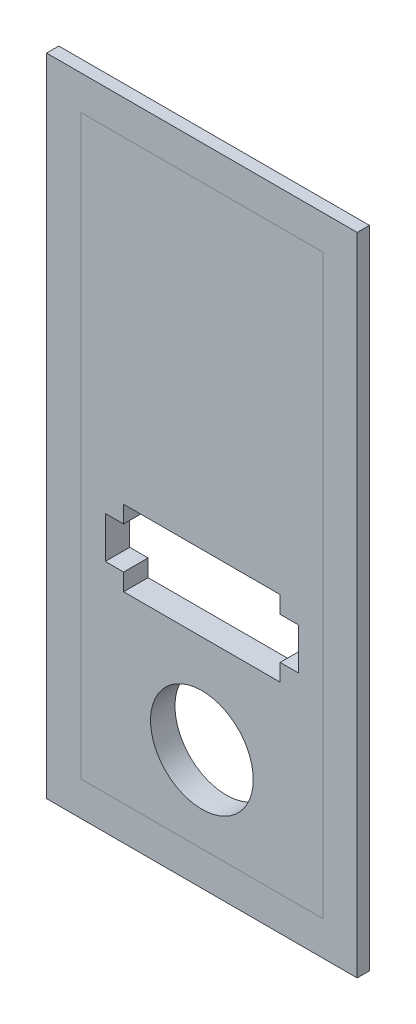
ISO-10303-21;
HEADER;
FILE_DESCRIPTION(('STEP AP214'),'2;1');
FILE_NAME('part.step','',(''),(''),'','','');
FILE_SCHEMA(('AUTOMOTIVE_DESIGN { 1 0 10303 214 1 1 1 1 }'));
ENDSEC;
DATA;
#1=APPLICATION_CONTEXT('core data for automotive mechanical design processes');
#2=APPLICATION_PROTOCOL_DEFINITION('international standard','automotive_design',2000,#1);
#3=PRODUCT_CONTEXT('',#1,'mechanical');
#4=PRODUCT('Part','Part','',(#3));
#5=PRODUCT_RELATED_PRODUCT_CATEGORY('part','',(#4));
#6=PRODUCT_DEFINITION_FORMATION('','',#4);
#7=PRODUCT_DEFINITION_CONTEXT('part definition',#1,'design');
#8=PRODUCT_DEFINITION('design','',#6,#7);
#9=PRODUCT_DEFINITION_SHAPE('','',#8);
#10=(LENGTH_UNIT() NAMED_UNIT(*) SI_UNIT(.MILLI.,.METRE.));
#11=(NAMED_UNIT(*) PLANE_ANGLE_UNIT() SI_UNIT($,.RADIAN.));
#12=(NAMED_UNIT(*) SI_UNIT($,.STERADIAN.) SOLID_ANGLE_UNIT());
#13=UNCERTAINTY_MEASURE_WITH_UNIT(LENGTH_MEASURE(1.E-05),#10,'distance_accuracy_value','');
#14=(GEOMETRIC_REPRESENTATION_CONTEXT(3) GLOBAL_UNCERTAINTY_ASSIGNED_CONTEXT((#13)) GLOBAL_UNIT_ASSIGNED_CONTEXT((#10,
#11,#12)) REPRESENTATION_CONTEXT('',''));
#15=CARTESIAN_POINT('',(0.,0.,0.));
#16=DIRECTION('',(0.,0.,1.));
#17=DIRECTION('',(1.,0.,0.));
#18=AXIS2_PLACEMENT_3D('',#15,#16,#17);
#19=CARTESIAN_POINT('',(-12.7,43.,1.));
#20=DIRECTION('',(0.,1.,0.));
#21=DIRECTION('',(0.,0.,1.));
#22=AXIS2_PLACEMENT_3D('',#19,#20,#21);
#23=PLANE('',#22);
#24=DIRECTION('',(-1.,0.,0.));
#25=VECTOR('',#24,1.);
#26=CARTESIAN_POINT('',(-12.7,43.,2.));
#27=LINE('',#26,#25);
#28=CARTESIAN_POINT('',(12.7,43.,2.));
#29=VERTEX_POINT('',#28);
#30=CARTESIAN_POINT('',(-12.7,43.,2.));
#31=VERTEX_POINT('',#30);
#32=EDGE_CURVE('E149',#29,#31,#27,.T.);
#33=ORIENTED_EDGE('',*,*,#32,.F.);
#34=DIRECTION('',(0.,0.,1.));
#35=VECTOR('',#34,1.);
#36=CARTESIAN_POINT('',(12.7,43.,1.));
#37=LINE('',#36,#35);
#38=CARTESIAN_POINT('',(12.7,43.,1.));
#39=VERTEX_POINT('',#38);
#40=EDGE_CURVE('E12',#39,#29,#37,.T.);
#41=ORIENTED_EDGE('',*,*,#40,.F.);
#42=DIRECTION('',(-1.,0.,0.));
#43=VECTOR('',#42,1.);
#44=CARTESIAN_POINT('',(-12.7,43.,1.));
#45=LINE('',#44,#43);
#46=CARTESIAN_POINT('',(-12.7,43.,1.));
#47=VERTEX_POINT('',#46);
#48=EDGE_CURVE('E153',#39,#47,#45,.T.);
#49=ORIENTED_EDGE('',*,*,#48,.T.);
#50=DIRECTION('',(0.,0.,1.));
#51=VECTOR('',#50,1.);
#52=CARTESIAN_POINT('',(-12.7,43.,1.));
#53=LINE('',#52,#51);
#54=EDGE_CURVE('E54',#47,#31,#53,.T.);
#55=ORIENTED_EDGE('',*,*,#54,.T.);
#56=EDGE_LOOP('',(#33,#41,#49,#55));
#57=FACE_BOUND('',#56,.T.);
#58=ADVANCED_FACE('F51',(#57),#23,.T.);
#59=CARTESIAN_POINT('',(12.7,43.,1.));
#60=DIRECTION('',(1.,0.,0.));
#61=DIRECTION('',(0.,1.,0.));
#62=AXIS2_PLACEMENT_3D('',#59,#60,#61);
#63=PLANE('',#62);
#64=DIRECTION('',(0.,1.,0.));
#65=VECTOR('',#64,1.);
#66=CARTESIAN_POINT('',(12.7,43.,2.));
#67=LINE('',#66,#65);
#68=CARTESIAN_POINT('',(12.7,-9.8,2.));
#69=VERTEX_POINT('',#68);
#70=EDGE_CURVE('E157',#69,#29,#67,.T.);
#71=ORIENTED_EDGE('',*,*,#70,.F.);
#72=DIRECTION('',(0.,0.,1.));
#73=VECTOR('',#72,1.);
#74=CARTESIAN_POINT('',(12.7,-9.8,1.));
#75=LINE('',#74,#73);
#76=CARTESIAN_POINT('',(12.7,-9.8,1.));
#77=VERTEX_POINT('',#76);
#78=EDGE_CURVE('E59',#77,#69,#75,.T.);
#79=ORIENTED_EDGE('',*,*,#78,.F.);
#80=DIRECTION('',(0.,1.,0.));
#81=VECTOR('',#80,1.);
#82=CARTESIAN_POINT('',(12.7,43.,1.));
#83=LINE('',#82,#81);
#84=EDGE_CURVE('E163',#77,#39,#83,.T.);
#85=ORIENTED_EDGE('',*,*,#84,.T.);
#86=ORIENTED_EDGE('',*,*,#40,.T.);
#87=EDGE_LOOP('',(#71,#79,#85,#86));
#88=FACE_BOUND('',#87,.T.);
#89=ADVANCED_FACE('F189',(#88),#63,.T.);
#90=CARTESIAN_POINT('',(-12.7,-9.8,1.));
#91=DIRECTION('',(0.,-1.,0.));
#92=DIRECTION('',(1.,0.,0.));
#93=AXIS2_PLACEMENT_3D('',#90,#91,#92);
#94=PLANE('',#93);
#95=DIRECTION('',(1.,0.,0.));
#96=VECTOR('',#95,1.);
#97=CARTESIAN_POINT('',(-12.7,-9.8,2.));
#98=LINE('',#97,#96);
#99=CARTESIAN_POINT('',(-12.7,-9.8,2.));
#100=VERTEX_POINT('',#99);
#101=EDGE_CURVE('E171',#100,#69,#98,.T.);
#102=ORIENTED_EDGE('',*,*,#101,.F.);
#103=DIRECTION('',(0.,0.,1.));
#104=VECTOR('',#103,1.);
#105=CARTESIAN_POINT('',(-12.7,-9.8,1.));
#106=LINE('',#105,#104);
#107=CARTESIAN_POINT('',(-12.7,-9.8,1.));
#108=VERTEX_POINT('',#107);
#109=EDGE_CURVE('E176',#108,#100,#106,.T.);
#110=ORIENTED_EDGE('',*,*,#109,.F.);
#111=DIRECTION('',(1.,0.,0.));
#112=VECTOR('',#111,1.);
#113=CARTESIAN_POINT('',(-12.7,-9.8,1.));
#114=LINE('',#113,#112);
#115=EDGE_CURVE('E160',#108,#77,#114,.T.);
#116=ORIENTED_EDGE('',*,*,#115,.T.);
#117=ORIENTED_EDGE('',*,*,#78,.T.);
#118=EDGE_LOOP('',(#102,#110,#116,#117));
#119=FACE_BOUND('',#118,.T.);
#120=ADVANCED_FACE('F193',(#119),#94,.T.);
#121=CARTESIAN_POINT('',(-12.7,43.,1.));
#122=DIRECTION('',(-1.,0.,0.));
#123=DIRECTION('',(0.,-1.,0.));
#124=AXIS2_PLACEMENT_3D('',#121,#122,#123);
#125=PLANE('',#124);
#126=DIRECTION('',(0.,-1.,0.));
#127=VECTOR('',#126,1.);
#128=CARTESIAN_POINT('',(-12.7,43.,2.));
#129=LINE('',#128,#127);
#130=EDGE_CURVE('E168',#31,#100,#129,.T.);
#131=ORIENTED_EDGE('',*,*,#130,.F.);
#132=ORIENTED_EDGE('',*,*,#54,.F.);
#133=DIRECTION('',(0.,-1.,0.));
#134=VECTOR('',#133,1.);
#135=CARTESIAN_POINT('',(-12.7,43.,1.));
#136=LINE('',#135,#134);
#137=EDGE_CURVE('E156',#47,#108,#136,.T.);
#138=ORIENTED_EDGE('',*,*,#137,.T.);
#139=ORIENTED_EDGE('',*,*,#109,.T.);
#140=EDGE_LOOP('',(#131,#132,#138,#139));
#141=FACE_BOUND('',#140,.T.);
#142=ADVANCED_FACE('F184',(#141),#125,.T.);
#143=CARTESIAN_POINT('',(0.,0.,1.));
#144=DIRECTION('',(0.,0.,-1.));
#145=DIRECTION('',(-1.,0.,0.));
#146=AXIS2_PLACEMENT_3D('',#143,#144,#145);
#147=PLANE('',#146);
#148=DIRECTION('',(0.,-1.,0.));
#149=VECTOR('',#148,1.);
#150=CARTESIAN_POINT('',(-9.9,40.2,1.));
#151=LINE('',#150,#149);
#152=CARTESIAN_POINT('',(-9.9,40.2,1.));
#153=VERTEX_POINT('',#152);
#154=CARTESIAN_POINT('',(-9.9,-7.,1.));
#155=VERTEX_POINT('',#154);
#156=EDGE_CURVE('E118',#153,#155,#151,.T.);
#157=ORIENTED_EDGE('',*,*,#156,.T.);
#158=DIRECTION('',(1.,0.,0.));
#159=VECTOR('',#158,1.);
#160=CARTESIAN_POINT('',(-9.9,-7.,1.));
#161=LINE('',#160,#159);
#162=CARTESIAN_POINT('',(9.90000000000001,-7.,1.));
#163=VERTEX_POINT('',#162);
#164=EDGE_CURVE('E127',#155,#163,#161,.T.);
#165=ORIENTED_EDGE('',*,*,#164,.T.);
#166=DIRECTION('',(0.,1.,0.));
#167=VECTOR('',#166,1.);
#168=CARTESIAN_POINT('',(9.9,40.2,1.));
#169=LINE('',#168,#167);
#170=CARTESIAN_POINT('',(9.9,40.2,1.));
#171=VERTEX_POINT('',#170);
#172=EDGE_CURVE('E67',#163,#171,#169,.T.);
#173=ORIENTED_EDGE('',*,*,#172,.T.);
#174=DIRECTION('',(-1.,0.,0.));
#175=VECTOR('',#174,1.);
#176=CARTESIAN_POINT('',(-9.9,40.2,1.));
#177=LINE('',#176,#175);
#178=EDGE_CURVE('E124',#171,#153,#177,.T.);
#179=ORIENTED_EDGE('',*,*,#178,.T.);
#180=EDGE_LOOP('',(#157,#165,#173,#179));
#181=FACE_BOUND('',#180,.T.);
#182=ORIENTED_EDGE('',*,*,#48,.F.);
#183=ORIENTED_EDGE('',*,*,#84,.F.);
#184=ORIENTED_EDGE('',*,*,#115,.F.);
#185=ORIENTED_EDGE('',*,*,#137,.F.);
#186=EDGE_LOOP('',(#182,#183,#184,#185));
#187=FACE_BOUND('',#186,.T.);
#188=ADVANCED_FACE('F131',(#181,#187),#147,.T.);
#189=CARTESIAN_POINT('',(0.,0.,2.));
#190=DIRECTION('',(0.,0.,-1.));
#191=DIRECTION('',(-1.,0.,0.));
#192=AXIS2_PLACEMENT_3D('',#189,#190,#191);
#193=PLANE('',#192);
#194=DIRECTION('',(1.,0.,0.));
#195=VECTOR('',#194,1.);
#196=CARTESIAN_POINT('',(-9.9,-7.,2.));
#197=LINE('',#196,#195);
#198=CARTESIAN_POINT('',(-9.9,-7.,2.));
#199=VERTEX_POINT('',#198);
#200=CARTESIAN_POINT('',(9.90000000000001,-7.,2.));
#201=VERTEX_POINT('',#200);
#202=EDGE_CURVE('E143',#199,#201,#197,.T.);
#203=ORIENTED_EDGE('',*,*,#202,.F.);
#204=DIRECTION('',(0.,-1.,0.));
#205=VECTOR('',#204,1.);
#206=CARTESIAN_POINT('',(-9.9,40.2,2.));
#207=LINE('',#206,#205);
#208=CARTESIAN_POINT('',(-9.9,40.2,2.));
#209=VERTEX_POINT('',#208);
#210=EDGE_CURVE('E75',#209,#199,#207,.T.);
#211=ORIENTED_EDGE('',*,*,#210,.F.);
#212=DIRECTION('',(-1.,0.,0.));
#213=VECTOR('',#212,1.);
#214=CARTESIAN_POINT('',(-9.9,40.2,2.));
#215=LINE('',#214,#213);
#216=CARTESIAN_POINT('',(9.9,40.2,2.));
#217=VERTEX_POINT('',#216);
#218=EDGE_CURVE('E134',#217,#209,#215,.T.);
#219=ORIENTED_EDGE('',*,*,#218,.F.);
#220=DIRECTION('',(0.,1.,0.));
#221=VECTOR('',#220,1.);
#222=CARTESIAN_POINT('',(9.9,40.2,2.));
#223=LINE('',#222,#221);
#224=EDGE_CURVE('E137',#201,#217,#223,.T.);
#225=ORIENTED_EDGE('',*,*,#224,.F.);
#226=EDGE_LOOP('',(#203,#211,#219,#225));
#227=FACE_BOUND('',#226,.T.);
#228=ORIENTED_EDGE('',*,*,#32,.T.);
#229=ORIENTED_EDGE('',*,*,#130,.T.);
#230=ORIENTED_EDGE('',*,*,#101,.T.);
#231=ORIENTED_EDGE('',*,*,#70,.T.);
#232=EDGE_LOOP('',(#228,#229,#230,#231));
#233=FACE_BOUND('',#232,.T.);
#234=ADVANCED_FACE('F186',(#227,#233),#193,.F.);
#235=CARTESIAN_POINT('',(-9.9,40.2,1.));
#236=DIRECTION('',(-1.,0.,0.));
#237=DIRECTION('',(0.,-1.,0.));
#238=AXIS2_PLACEMENT_3D('',#235,#236,#237);
#239=PLANE('',#238);
#240=ORIENTED_EDGE('',*,*,#210,.T.);
#241=DIRECTION('',(0.,0.,1.));
#242=VECTOR('',#241,1.);
#243=CARTESIAN_POINT('',(-9.9,-7.,1.));
#244=LINE('',#243,#242);
#245=EDGE_CURVE('E114',#155,#199,#244,.T.);
#246=ORIENTED_EDGE('',*,*,#245,.F.);
#247=ORIENTED_EDGE('',*,*,#156,.F.);
#248=DIRECTION('',(0.,0.,1.));
#249=VECTOR('',#248,1.);
#250=CARTESIAN_POINT('',(-9.9,40.2,1.));
#251=LINE('',#250,#249);
#252=EDGE_CURVE('E147',#153,#209,#251,.T.);
#253=ORIENTED_EDGE('',*,*,#252,.T.);
#254=EDGE_LOOP('',(#240,#246,#247,#253));
#255=FACE_BOUND('',#254,.T.);
#256=ADVANCED_FACE('F116',(#255),#239,.F.);
#257=CARTESIAN_POINT('',(-9.9,40.2,1.));
#258=DIRECTION('',(0.,1.,0.));
#259=DIRECTION('',(0.,0.,1.));
#260=AXIS2_PLACEMENT_3D('',#257,#258,#259);
#261=PLANE('',#260);
#262=ORIENTED_EDGE('',*,*,#218,.T.);
#263=ORIENTED_EDGE('',*,*,#252,.F.);
#264=ORIENTED_EDGE('',*,*,#178,.F.);
#265=DIRECTION('',(0.,0.,1.));
#266=VECTOR('',#265,1.);
#267=CARTESIAN_POINT('',(9.9,40.2,1.));
#268=LINE('',#267,#266);
#269=EDGE_CURVE('E150',#171,#217,#268,.T.);
#270=ORIENTED_EDGE('',*,*,#269,.T.);
#271=EDGE_LOOP('',(#262,#263,#264,#270));
#272=FACE_BOUND('',#271,.T.);
#273=ADVANCED_FACE('F234',(#272),#261,.F.);
#274=CARTESIAN_POINT('',(9.9,40.2,1.));
#275=DIRECTION('',(1.,0.,0.));
#276=DIRECTION('',(0.,1.,0.));
#277=AXIS2_PLACEMENT_3D('',#274,#275,#276);
#278=PLANE('',#277);
#279=ORIENTED_EDGE('',*,*,#224,.T.);
#280=ORIENTED_EDGE('',*,*,#269,.F.);
#281=ORIENTED_EDGE('',*,*,#172,.F.);
#282=DIRECTION('',(0.,0.,1.));
#283=VECTOR('',#282,1.);
#284=CARTESIAN_POINT('',(9.90000000000001,-7.,1.));
#285=LINE('',#284,#283);
#286=EDGE_CURVE('E123',#163,#201,#285,.T.);
#287=ORIENTED_EDGE('',*,*,#286,.T.);
#288=EDGE_LOOP('',(#279,#280,#281,#287));
#289=FACE_BOUND('',#288,.T.);
#290=ADVANCED_FACE('F241',(#289),#278,.F.);
#291=CARTESIAN_POINT('',(-9.9,-7.,1.));
#292=DIRECTION('',(0.,-1.,0.));
#293=DIRECTION('',(0.,0.,-1.));
#294=AXIS2_PLACEMENT_3D('',#291,#292,#293);
#295=PLANE('',#294);
#296=ORIENTED_EDGE('',*,*,#202,.T.);
#297=ORIENTED_EDGE('',*,*,#286,.F.);
#298=ORIENTED_EDGE('',*,*,#164,.F.);
#299=ORIENTED_EDGE('',*,*,#245,.T.);
#300=EDGE_LOOP('',(#296,#297,#298,#299));
#301=FACE_BOUND('',#300,.T.);
#302=ADVANCED_FACE('F128',(#301),#295,.F.);
#303=CLOSED_SHELL('',(#58,#89,#120,#142,#188,#234,#256,#273,#290,#302));
#304=MANIFOLD_SOLID_BREP('B2',#303);
#305=CARTESIAN_POINT('',(0.,12.8,2.));
#306=DIRECTION('',(0.,-1.,0.));
#307=DIRECTION('',(0.,0.,-1.));
#308=AXIS2_PLACEMENT_3D('',#305,#306,#307);
#309=PLANE('',#308);
#310=DIRECTION('',(-1.,0.,0.));
#311=VECTOR('',#310,1.);
#312=CARTESIAN_POINT('',(0.,12.8,0.));
#313=LINE('',#312,#311);
#314=CARTESIAN_POINT('',(7.9,12.8,0.));
#315=VERTEX_POINT('',#314);
#316=CARTESIAN_POINT('',(6.4,12.8,0.));
#317=VERTEX_POINT('',#316);
#318=EDGE_CURVE('E468',#315,#317,#313,.T.);
#319=ORIENTED_EDGE('',*,*,#318,.F.);
#320=DIRECTION('',(0.,0.,-1.));
#321=VECTOR('',#320,1.);
#322=CARTESIAN_POINT('',(7.9,12.8,2.));
#323=LINE('',#322,#321);
#324=CARTESIAN_POINT('',(7.9,12.8,2.));
#325=VERTEX_POINT('',#324);
#326=EDGE_CURVE('E49',#325,#315,#323,.T.);
#327=ORIENTED_EDGE('',*,*,#326,.F.);
#328=DIRECTION('',(-1.,0.,0.));
#329=VECTOR('',#328,1.);
#330=CARTESIAN_POINT('',(0.,12.8,2.));
#331=LINE('',#330,#329);
#332=CARTESIAN_POINT('',(6.4,12.8,2.));
#333=VERTEX_POINT('',#332);
#334=EDGE_CURVE('E431',#325,#333,#331,.T.);
#335=ORIENTED_EDGE('',*,*,#334,.T.);
#336=DIRECTION('',(0.,0.,-1.));
#337=VECTOR('',#336,1.);
#338=CARTESIAN_POINT('',(6.4,12.8,2.));
#339=LINE('',#338,#337);
#340=EDGE_CURVE('E339',#333,#317,#339,.T.);
#341=ORIENTED_EDGE('',*,*,#340,.T.);
#342=EDGE_LOOP('',(#319,#327,#335,#341));
#343=FACE_BOUND('',#342,.T.);
#344=ADVANCED_FACE('F261',(#343),#309,.T.);
#345=CARTESIAN_POINT('',(7.9,0.,2.));
#346=DIRECTION('',(1.,0.,0.));
#347=DIRECTION('',(0.,1.,0.));
#348=AXIS2_PLACEMENT_3D('',#345,#346,#347);
#349=PLANE('',#348);
#350=DIRECTION('',(0.,-1.,0.));
#351=VECTOR('',#350,1.);
#352=CARTESIAN_POINT('',(7.9,0.,0.));
#353=LINE('',#352,#351);
#354=CARTESIAN_POINT('',(7.9,9.4,0.));
#355=VERTEX_POINT('',#354);
#356=EDGE_CURVE('E463',#315,#355,#353,.T.);
#357=ORIENTED_EDGE('',*,*,#356,.T.);
#358=DIRECTION('',(0.,0.,-1.));
#359=VECTOR('',#358,1.);
#360=CARTESIAN_POINT('',(7.9,9.4,2.));
#361=LINE('',#360,#359);
#362=CARTESIAN_POINT('',(7.9,9.4,2.));
#363=VERTEX_POINT('',#362);
#364=EDGE_CURVE('E271',#363,#355,#361,.T.);
#365=ORIENTED_EDGE('',*,*,#364,.F.);
#366=DIRECTION('',(0.,-1.,0.));
#367=VECTOR('',#366,1.);
#368=CARTESIAN_POINT('',(7.9,0.,2.));
#369=LINE('',#368,#367);
#370=EDGE_CURVE('E428',#325,#363,#369,.T.);
#371=ORIENTED_EDGE('',*,*,#370,.F.);
#372=ORIENTED_EDGE('',*,*,#326,.T.);
#373=EDGE_LOOP('',(#357,#365,#371,#372));
#374=FACE_BOUND('',#373,.T.);
#375=ADVANCED_FACE('F546',(#374),#349,.F.);
#376=CARTESIAN_POINT('',(0.,9.4,2.));
#377=DIRECTION('',(0.,-1.,0.));
#378=DIRECTION('',(0.,0.,-1.));
#379=AXIS2_PLACEMENT_3D('',#376,#377,#378);
#380=PLANE('',#379);
#381=DIRECTION('',(-1.,0.,0.));
#382=VECTOR('',#381,1.);
#383=CARTESIAN_POINT('',(0.,9.4,0.));
#384=LINE('',#383,#382);
#385=CARTESIAN_POINT('',(6.4,9.4,0.));
#386=VERTEX_POINT('',#385);
#387=EDGE_CURVE('E456',#355,#386,#384,.T.);
#388=ORIENTED_EDGE('',*,*,#387,.T.);
#389=DIRECTION('',(0.,0.,-1.));
#390=VECTOR('',#389,1.);
#391=CARTESIAN_POINT('',(6.4,9.4,2.));
#392=LINE('',#391,#390);
#393=CARTESIAN_POINT('',(6.4,9.4,2.));
#394=VERTEX_POINT('',#393);
#395=EDGE_CURVE('E511',#394,#386,#392,.T.);
#396=ORIENTED_EDGE('',*,*,#395,.F.);
#397=DIRECTION('',(-1.,0.,0.));
#398=VECTOR('',#397,1.);
#399=CARTESIAN_POINT('',(0.,9.4,2.));
#400=LINE('',#399,#398);
#401=EDGE_CURVE('E423',#363,#394,#400,.T.);
#402=ORIENTED_EDGE('',*,*,#401,.F.);
#403=ORIENTED_EDGE('',*,*,#364,.T.);
#404=EDGE_LOOP('',(#388,#396,#402,#403));
#405=FACE_BOUND('',#404,.T.);
#406=ADVANCED_FACE('F544',(#405),#380,.F.);
#407=CARTESIAN_POINT('',(6.4,0.,2.));
#408=DIRECTION('',(1.,0.,0.));
#409=DIRECTION('',(0.,1.,0.));
#410=AXIS2_PLACEMENT_3D('',#407,#408,#409);
#411=PLANE('',#410);
#412=DIRECTION('',(0.,-1.,0.));
#413=VECTOR('',#412,1.);
#414=CARTESIAN_POINT('',(6.4,0.,0.));
#415=LINE('',#414,#413);
#416=CARTESIAN_POINT('',(6.4,8.00000000000001,0.));
#417=VERTEX_POINT('',#416);
#418=EDGE_CURVE('E449',#386,#417,#415,.T.);
#419=ORIENTED_EDGE('',*,*,#418,.T.);
#420=DIRECTION('',(0.,0.,-1.));
#421=VECTOR('',#420,1.);
#422=CARTESIAN_POINT('',(6.4,8.00000000000001,2.));
#423=LINE('',#422,#421);
#424=CARTESIAN_POINT('',(6.4,8.00000000000001,2.));
#425=VERTEX_POINT('',#424);
#426=EDGE_CURVE('E509',#425,#417,#423,.T.);
#427=ORIENTED_EDGE('',*,*,#426,.F.);
#428=DIRECTION('',(0.,-1.,0.));
#429=VECTOR('',#428,1.);
#430=CARTESIAN_POINT('',(6.4,0.,2.));
#431=LINE('',#430,#429);
#432=EDGE_CURVE('E420',#394,#425,#431,.T.);
#433=ORIENTED_EDGE('',*,*,#432,.F.);
#434=ORIENTED_EDGE('',*,*,#395,.T.);
#435=EDGE_LOOP('',(#419,#427,#433,#434));
#436=FACE_BOUND('',#435,.T.);
#437=ADVANCED_FACE('F541',(#436),#411,.F.);
#438=CARTESIAN_POINT('',(0.,8.,2.));
#439=DIRECTION('',(0.,1.,0.));
#440=DIRECTION('',(-1.,0.,0.));
#441=AXIS2_PLACEMENT_3D('',#438,#439,#440);
#442=PLANE('',#441);
#443=DIRECTION('',(1.,0.,0.));
#444=VECTOR('',#443,1.);
#445=CARTESIAN_POINT('',(0.,8.,0.));
#446=LINE('',#445,#444);
#447=CARTESIAN_POINT('',(-6.4,8.,0.));
#448=VERTEX_POINT('',#447);
#449=EDGE_CURVE('E455',#448,#417,#446,.T.);
#450=ORIENTED_EDGE('',*,*,#449,.F.);
#451=DIRECTION('',(0.,0.,-1.));
#452=VECTOR('',#451,1.);
#453=CARTESIAN_POINT('',(-6.4,8.,2.));
#454=LINE('',#453,#452);
#455=CARTESIAN_POINT('',(-6.4,8.,2.));
#456=VERTEX_POINT('',#455);
#457=EDGE_CURVE('E503',#456,#448,#454,.T.);
#458=ORIENTED_EDGE('',*,*,#457,.F.);
#459=DIRECTION('',(1.,0.,0.));
#460=VECTOR('',#459,1.);
#461=CARTESIAN_POINT('',(0.,8.,2.));
#462=LINE('',#461,#460);
#463=EDGE_CURVE('E415',#456,#425,#462,.T.);
#464=ORIENTED_EDGE('',*,*,#463,.T.);
#465=ORIENTED_EDGE('',*,*,#426,.T.);
#466=EDGE_LOOP('',(#450,#458,#464,#465));
#467=FACE_BOUND('',#466,.T.);
#468=ADVANCED_FACE('F540',(#467),#442,.T.);
#469=CARTESIAN_POINT('',(-6.4,0.,2.));
#470=DIRECTION('',(1.,0.,0.));
#471=DIRECTION('',(0.,1.,0.));
#472=AXIS2_PLACEMENT_3D('',#469,#470,#471);
#473=PLANE('',#472);
#474=DIRECTION('',(0.,-1.,0.));
#475=VECTOR('',#474,1.);
#476=CARTESIAN_POINT('',(-6.4,0.,0.));
#477=LINE('',#476,#475);
#478=CARTESIAN_POINT('',(-6.4,9.4,0.));
#479=VERTEX_POINT('',#478);
#480=EDGE_CURVE('E461',#479,#448,#477,.T.);
#481=ORIENTED_EDGE('',*,*,#480,.F.);
#482=DIRECTION('',(0.,0.,-1.));
#483=VECTOR('',#482,1.);
#484=CARTESIAN_POINT('',(-6.4,9.4,2.));
#485=LINE('',#484,#483);
#486=CARTESIAN_POINT('',(-6.4,9.4,2.));
#487=VERTEX_POINT('',#486);
#488=EDGE_CURVE('E497',#487,#479,#485,.T.);
#489=ORIENTED_EDGE('',*,*,#488,.F.);
#490=DIRECTION('',(0.,-1.,0.));
#491=VECTOR('',#490,1.);
#492=CARTESIAN_POINT('',(-6.4,0.,2.));
#493=LINE('',#492,#491);
#494=EDGE_CURVE('E408',#487,#456,#493,.T.);
#495=ORIENTED_EDGE('',*,*,#494,.T.);
#496=ORIENTED_EDGE('',*,*,#457,.T.);
#497=EDGE_LOOP('',(#481,#489,#495,#496));
#498=FACE_BOUND('',#497,.T.);
#499=ADVANCED_FACE('F539',(#498),#473,.T.);
#500=CARTESIAN_POINT('',(0.,9.4,2.));
#501=DIRECTION('',(0.,1.,0.));
#502=DIRECTION('',(0.,0.,1.));
#503=AXIS2_PLACEMENT_3D('',#500,#501,#502);
#504=PLANE('',#503);
#505=DIRECTION('',(1.,0.,0.));
#506=VECTOR('',#505,1.);
#507=CARTESIAN_POINT('',(0.,9.4,0.));
#508=LINE('',#507,#506);
#509=CARTESIAN_POINT('',(-7.9,9.4,0.));
#510=VERTEX_POINT('',#509);
#511=EDGE_CURVE('E500',#510,#479,#508,.T.);
#512=ORIENTED_EDGE('',*,*,#511,.F.);
#513=DIRECTION('',(0.,0.,-1.));
#514=VECTOR('',#513,1.);
#515=CARTESIAN_POINT('',(-7.9,9.4,2.));
#516=LINE('',#515,#514);
#517=CARTESIAN_POINT('',(-7.9,9.4,2.));
#518=VERTEX_POINT('',#517);
#519=EDGE_CURVE('E491',#518,#510,#516,.T.);
#520=ORIENTED_EDGE('',*,*,#519,.F.);
#521=DIRECTION('',(1.,0.,0.));
#522=VECTOR('',#521,1.);
#523=CARTESIAN_POINT('',(0.,9.4,2.));
#524=LINE('',#523,#522);
#525=EDGE_CURVE('E414',#518,#487,#524,.T.);
#526=ORIENTED_EDGE('',*,*,#525,.T.);
#527=ORIENTED_EDGE('',*,*,#488,.T.);
#528=EDGE_LOOP('',(#512,#520,#526,#527));
#529=FACE_BOUND('',#528,.T.);
#530=ADVANCED_FACE('F496',(#529),#504,.T.);
#531=CARTESIAN_POINT('',(-7.89999999999999,0.,2.));
#532=DIRECTION('',(1.,0.,0.));
#533=DIRECTION('',(0.,1.,0.));
#534=AXIS2_PLACEMENT_3D('',#531,#532,#533);
#535=PLANE('',#534);
#536=DIRECTION('',(0.,-1.,0.));
#537=VECTOR('',#536,1.);
#538=CARTESIAN_POINT('',(-7.89999999999999,0.,0.));
#539=LINE('',#538,#537);
#540=CARTESIAN_POINT('',(-7.9,12.8,0.));
#541=VERTEX_POINT('',#540);
#542=EDGE_CURVE('E532',#541,#510,#539,.T.);
#543=ORIENTED_EDGE('',*,*,#542,.F.);
#544=DIRECTION('',(0.,0.,-1.));
#545=VECTOR('',#544,1.);
#546=CARTESIAN_POINT('',(-7.9,12.8,2.));
#547=LINE('',#546,#545);
#548=CARTESIAN_POINT('',(-7.9,12.8,2.));
#549=VERTEX_POINT('',#548);
#550=EDGE_CURVE('E493',#549,#541,#547,.T.);
#551=ORIENTED_EDGE('',*,*,#550,.F.);
#552=DIRECTION('',(0.,-1.,0.));
#553=VECTOR('',#552,1.);
#554=CARTESIAN_POINT('',(-7.89999999999999,0.,2.));
#555=LINE('',#554,#553);
#556=EDGE_CURVE('E409',#549,#518,#555,.T.);
#557=ORIENTED_EDGE('',*,*,#556,.T.);
#558=ORIENTED_EDGE('',*,*,#519,.T.);
#559=EDGE_LOOP('',(#543,#551,#557,#558));
#560=FACE_BOUND('',#559,.T.);
#561=ADVANCED_FACE('F490',(#560),#535,.T.);
#562=CARTESIAN_POINT('',(0.,12.8,2.));
#563=DIRECTION('',(0.,1.,0.));
#564=DIRECTION('',(-1.,0.,0.));
#565=AXIS2_PLACEMENT_3D('',#562,#563,#564);
#566=PLANE('',#565);
#567=DIRECTION('',(1.,0.,0.));
#568=VECTOR('',#567,1.);
#569=CARTESIAN_POINT('',(0.,12.8,0.));
#570=LINE('',#569,#568);
#571=CARTESIAN_POINT('',(-6.4,12.8,0.));
#572=VERTEX_POINT('',#571);
#573=EDGE_CURVE('E530',#541,#572,#570,.T.);
#574=ORIENTED_EDGE('',*,*,#573,.T.);
#575=DIRECTION('',(0.,0.,-1.));
#576=VECTOR('',#575,1.);
#577=CARTESIAN_POINT('',(-6.4,12.8,2.));
#578=LINE('',#577,#576);
#579=CARTESIAN_POINT('',(-6.4,12.8,2.));
#580=VERTEX_POINT('',#579);
#581=EDGE_CURVE('E395',#580,#572,#578,.T.);
#582=ORIENTED_EDGE('',*,*,#581,.F.);
#583=DIRECTION('',(1.,0.,0.));
#584=VECTOR('',#583,1.);
#585=CARTESIAN_POINT('',(0.,12.8,2.));
#586=LINE('',#585,#584);
#587=EDGE_CURVE('E405',#549,#580,#586,.T.);
#588=ORIENTED_EDGE('',*,*,#587,.F.);
#589=ORIENTED_EDGE('',*,*,#550,.T.);
#590=EDGE_LOOP('',(#574,#582,#588,#589));
#591=FACE_BOUND('',#590,.T.);
#592=ADVANCED_FACE('F531',(#591),#566,.F.);
#593=CARTESIAN_POINT('',(-6.4,14.2,0.));
#594=VERTEX_POINT('',#593);
#595=EDGE_CURVE('E392',#594,#572,#477,.T.);
#596=ORIENTED_EDGE('',*,*,#595,.F.);
#597=DIRECTION('',(0.,0.,-1.));
#598=VECTOR('',#597,1.);
#599=CARTESIAN_POINT('',(-6.4,14.2,2.));
#600=LINE('',#599,#598);
#601=CARTESIAN_POINT('',(-6.4,14.2,2.));
#602=VERTEX_POINT('',#601);
#603=EDGE_CURVE('E386',#602,#594,#600,.T.);
#604=ORIENTED_EDGE('',*,*,#603,.F.);
#605=EDGE_CURVE('E390',#602,#580,#493,.T.);
#606=ORIENTED_EDGE('',*,*,#605,.T.);
#607=ORIENTED_EDGE('',*,*,#581,.T.);
#608=EDGE_LOOP('',(#596,#604,#606,#607));
#609=FACE_BOUND('',#608,.T.);
#610=ADVANCED_FACE('F388',(#609),#473,.T.);
#611=CARTESIAN_POINT('',(0.,14.2,2.));
#612=DIRECTION('',(0.,1.,0.));
#613=DIRECTION('',(-1.,0.,0.));
#614=AXIS2_PLACEMENT_3D('',#611,#612,#613);
#615=PLANE('',#614);
#616=DIRECTION('',(1.,0.,0.));
#617=VECTOR('',#616,1.);
#618=CARTESIAN_POINT('',(0.,14.2,0.));
#619=LINE('',#618,#617);
#620=CARTESIAN_POINT('',(6.4,14.2,0.));
#621=VERTEX_POINT('',#620);
#622=EDGE_CURVE('E447',#594,#621,#619,.T.);
#623=ORIENTED_EDGE('',*,*,#622,.T.);
#624=DIRECTION('',(0.,0.,-1.));
#625=VECTOR('',#624,1.);
#626=CARTESIAN_POINT('',(6.4,14.2,2.));
#627=LINE('',#626,#625);
#628=CARTESIAN_POINT('',(6.4,14.2,2.));
#629=VERTEX_POINT('',#628);
#630=EDGE_CURVE('E396',#629,#621,#627,.T.);
#631=ORIENTED_EDGE('',*,*,#630,.F.);
#632=DIRECTION('',(1.,0.,0.));
#633=VECTOR('',#632,1.);
#634=CARTESIAN_POINT('',(0.,14.2,2.));
#635=LINE('',#634,#633);
#636=EDGE_CURVE('E399',#602,#629,#635,.T.);
#637=ORIENTED_EDGE('',*,*,#636,.F.);
#638=ORIENTED_EDGE('',*,*,#603,.T.);
#639=EDGE_LOOP('',(#623,#631,#637,#638));
#640=FACE_BOUND('',#639,.T.);
#641=ADVANCED_FACE('F400',(#640),#615,.F.);
#642=CARTESIAN_POINT('',(9.90000000000001,0.,2.));
#643=DIRECTION('',(1.,0.,0.));
#644=DIRECTION('',(0.,1.,0.));
#645=AXIS2_PLACEMENT_3D('',#642,#643,#644);
#646=PLANE('',#645);
#647=DIRECTION('',(0.,-1.,0.));
#648=VECTOR('',#647,1.);
#649=CARTESIAN_POINT('',(9.90000000000001,0.,0.));
#650=LINE('',#649,#648);
#651=CARTESIAN_POINT('',(9.9,40.2,0.));
#652=VERTEX_POINT('',#651);
#653=CARTESIAN_POINT('',(9.90000000000001,-7.,0.));
#654=VERTEX_POINT('',#653);
#655=EDGE_CURVE('E481',#652,#654,#650,.T.);
#656=ORIENTED_EDGE('',*,*,#655,.F.);
#657=DIRECTION('',(0.,0.,-1.));
#658=VECTOR('',#657,1.);
#659=CARTESIAN_POINT('',(9.9,40.2,2.));
#660=LINE('',#659,#658);
#661=CARTESIAN_POINT('',(9.9,40.2,2.));
#662=VERTEX_POINT('',#661);
#663=EDGE_CURVE('E265',#662,#652,#660,.T.);
#664=ORIENTED_EDGE('',*,*,#663,.F.);
#665=DIRECTION('',(0.,-1.,0.));
#666=VECTOR('',#665,1.);
#667=CARTESIAN_POINT('',(9.90000000000001,0.,2.));
#668=LINE('',#667,#666);
#669=CARTESIAN_POINT('',(9.90000000000001,-7.,2.));
#670=VERTEX_POINT('',#669);
#671=EDGE_CURVE('E441',#662,#670,#668,.T.);
#672=ORIENTED_EDGE('',*,*,#671,.T.);
#673=DIRECTION('',(0.,0.,-1.));
#674=VECTOR('',#673,1.);
#675=CARTESIAN_POINT('',(9.90000000000001,-7.,2.));
#676=LINE('',#675,#674);
#677=EDGE_CURVE('E514',#670,#654,#676,.T.);
#678=ORIENTED_EDGE('',*,*,#677,.T.);
#679=EDGE_LOOP('',(#656,#664,#672,#678));
#680=FACE_BOUND('',#679,.T.);
#681=ADVANCED_FACE('F571',(#680),#646,.T.);
#682=CARTESIAN_POINT('',(0.,40.2,2.));
#683=DIRECTION('',(0.,1.,0.));
#684=DIRECTION('',(0.,0.,1.));
#685=AXIS2_PLACEMENT_3D('',#682,#683,#684);
#686=PLANE('',#685);
#687=DIRECTION('',(1.,0.,0.));
#688=VECTOR('',#687,1.);
#689=CARTESIAN_POINT('',(0.,40.2,0.));
#690=LINE('',#689,#688);
#691=CARTESIAN_POINT('',(-9.9,40.2,0.));
#692=VERTEX_POINT('',#691);
#693=EDGE_CURVE('E478',#692,#652,#690,.T.);
#694=ORIENTED_EDGE('',*,*,#693,.F.);
#695=DIRECTION('',(0.,0.,-1.));
#696=VECTOR('',#695,1.);
#697=CARTESIAN_POINT('',(-9.9,40.2,2.));
#698=LINE('',#697,#696);
#699=CARTESIAN_POINT('',(-9.9,40.2,2.));
#700=VERTEX_POINT('',#699);
#701=EDGE_CURVE('E518',#700,#692,#698,.T.);
#702=ORIENTED_EDGE('',*,*,#701,.F.);
#703=DIRECTION('',(1.,0.,0.));
#704=VECTOR('',#703,1.);
#705=CARTESIAN_POINT('',(0.,40.2,2.));
#706=LINE('',#705,#704);
#707=EDGE_CURVE('E438',#700,#662,#706,.T.);
#708=ORIENTED_EDGE('',*,*,#707,.T.);
#709=ORIENTED_EDGE('',*,*,#663,.T.);
#710=EDGE_LOOP('',(#694,#702,#708,#709));
#711=FACE_BOUND('',#710,.T.);
#712=ADVANCED_FACE('F569',(#711),#686,.T.);
#713=CARTESIAN_POINT('',(-9.90000000000001,0.,2.));
#714=DIRECTION('',(1.,0.,0.));
#715=DIRECTION('',(0.,1.,0.));
#716=AXIS2_PLACEMENT_3D('',#713,#714,#715);
#717=PLANE('',#716);
#718=DIRECTION('',(0.,-1.,0.));
#719=VECTOR('',#718,1.);
#720=CARTESIAN_POINT('',(-9.90000000000001,0.,0.));
#721=LINE('',#720,#719);
#722=CARTESIAN_POINT('',(-9.90000000000001,-7.,0.));
#723=VERTEX_POINT('',#722);
#724=EDGE_CURVE('E475',#692,#723,#721,.T.);
#725=ORIENTED_EDGE('',*,*,#724,.T.);
#726=DIRECTION('',(0.,0.,-1.));
#727=VECTOR('',#726,1.);
#728=CARTESIAN_POINT('',(-9.90000000000001,-7.,2.));
#729=LINE('',#728,#727);
#730=CARTESIAN_POINT('',(-9.90000000000001,-7.,2.));
#731=VERTEX_POINT('',#730);
#732=EDGE_CURVE('E516',#731,#723,#729,.T.);
#733=ORIENTED_EDGE('',*,*,#732,.F.);
#734=DIRECTION('',(0.,-1.,0.));
#735=VECTOR('',#734,1.);
#736=CARTESIAN_POINT('',(-9.90000000000001,0.,2.));
#737=LINE('',#736,#735);
#738=EDGE_CURVE('E435',#700,#731,#737,.T.);
#739=ORIENTED_EDGE('',*,*,#738,.F.);
#740=ORIENTED_EDGE('',*,*,#701,.T.);
#741=EDGE_LOOP('',(#725,#733,#739,#740));
#742=FACE_BOUND('',#741,.T.);
#743=ADVANCED_FACE('F565',(#742),#717,.F.);
#744=CARTESIAN_POINT('',(0.,-7.,2.));
#745=DIRECTION('',(0.,1.,0.));
#746=DIRECTION('',(0.,0.,1.));
#747=AXIS2_PLACEMENT_3D('',#744,#745,#746);
#748=PLANE('',#747);
#749=DIRECTION('',(1.,0.,0.));
#750=VECTOR('',#749,1.);
#751=CARTESIAN_POINT('',(0.,-7.,0.));
#752=LINE('',#751,#750);
#753=EDGE_CURVE('E472',#723,#654,#752,.T.);
#754=ORIENTED_EDGE('',*,*,#753,.T.);
#755=ORIENTED_EDGE('',*,*,#677,.F.);
#756=DIRECTION('',(1.,0.,0.));
#757=VECTOR('',#756,1.);
#758=CARTESIAN_POINT('',(0.,-7.,2.));
#759=LINE('',#758,#757);
#760=EDGE_CURVE('E433',#731,#670,#759,.T.);
#761=ORIENTED_EDGE('',*,*,#760,.F.);
#762=ORIENTED_EDGE('',*,*,#732,.T.);
#763=EDGE_LOOP('',(#754,#755,#761,#762));
#764=FACE_BOUND('',#763,.T.);
#765=ADVANCED_FACE('F562',(#764),#748,.F.);
#766=CARTESIAN_POINT('',(0.,0.,2.));
#767=DIRECTION('',(0.,0.,-1.));
#768=DIRECTION('',(-1.,0.,0.));
#769=AXIS2_PLACEMENT_3D('',#766,#767,#768);
#770=CYLINDRICAL_SURFACE('',#769,4.2);
#771=CARTESIAN_POINT('',(0.,0.,2.));
#772=DIRECTION('',(0.,0.,1.));
#773=DIRECTION('',(1.,0.,0.));
#774=AXIS2_PLACEMENT_3D('',#771,#772,#773);
#775=CIRCLE('',#774,4.2);
#776=CARTESIAN_POINT('',(4.2,0.,2.));
#777=VERTEX_POINT('',#776);
#778=EDGE_CURVE('E443',#777,#777,#775,.T.);
#779=ORIENTED_EDGE('',*,*,#778,.T.);
#780=EDGE_LOOP('',(#779));
#781=FACE_BOUND('',#780,.T.);
#782=CARTESIAN_POINT('',(0.,0.,0.));
#783=DIRECTION('',(0.,0.,1.));
#784=DIRECTION('',(1.,0.,0.));
#785=AXIS2_PLACEMENT_3D('',#782,#783,#784);
#786=CIRCLE('',#785,4.2);
#787=CARTESIAN_POINT('',(4.2,0.,0.));
#788=VERTEX_POINT('',#787);
#789=EDGE_CURVE('E484',#788,#788,#786,.T.);
#790=ORIENTED_EDGE('',*,*,#789,.F.);
#791=EDGE_LOOP('',(#790));
#792=FACE_BOUND('',#791,.T.);
#793=ADVANCED_FACE('F263',(#781,#792),#770,.F.);
#794=EDGE_CURVE('E332',#621,#317,#415,.T.);
#795=ORIENTED_EDGE('',*,*,#794,.T.);
#796=ORIENTED_EDGE('',*,*,#340,.F.);
#797=EDGE_CURVE('E280',#629,#333,#431,.T.);
#798=ORIENTED_EDGE('',*,*,#797,.F.);
#799=ORIENTED_EDGE('',*,*,#630,.T.);
#800=EDGE_LOOP('',(#795,#796,#798,#799));
#801=FACE_BOUND('',#800,.T.);
#802=ADVANCED_FACE('F553',(#801),#411,.F.);
#803=CARTESIAN_POINT('',(0.,0.,2.));
#804=DIRECTION('',(0.,0.,1.));
#805=DIRECTION('',(1.,0.,0.));
#806=AXIS2_PLACEMENT_3D('',#803,#804,#805);
#807=PLANE('',#806);
#808=ORIENTED_EDGE('',*,*,#778,.F.);
#809=EDGE_LOOP('',(#808));
#810=FACE_BOUND('',#809,.T.);
#811=ORIENTED_EDGE('',*,*,#671,.F.);
#812=ORIENTED_EDGE('',*,*,#707,.F.);
#813=ORIENTED_EDGE('',*,*,#738,.T.);
#814=ORIENTED_EDGE('',*,*,#760,.T.);
#815=EDGE_LOOP('',(#811,#812,#813,#814));
#816=FACE_BOUND('',#815,.T.);
#817=ORIENTED_EDGE('',*,*,#334,.F.);
#818=ORIENTED_EDGE('',*,*,#370,.T.);
#819=ORIENTED_EDGE('',*,*,#401,.T.);
#820=ORIENTED_EDGE('',*,*,#432,.T.);
#821=ORIENTED_EDGE('',*,*,#463,.F.);
#822=ORIENTED_EDGE('',*,*,#494,.F.);
#823=ORIENTED_EDGE('',*,*,#525,.F.);
#824=ORIENTED_EDGE('',*,*,#556,.F.);
#825=ORIENTED_EDGE('',*,*,#587,.T.);
#826=ORIENTED_EDGE('',*,*,#605,.F.);
#827=ORIENTED_EDGE('',*,*,#636,.T.);
#828=ORIENTED_EDGE('',*,*,#797,.T.);
#829=EDGE_LOOP('',(#817,#818,#819,#820,#821,#822,#823,#824,#825,#826,#827,#828));
#830=FACE_BOUND('',#829,.T.);
#831=ADVANCED_FACE('F402',(#810,#816,#830),#807,.T.);
#832=CARTESIAN_POINT('',(0.,0.,0.));
#833=DIRECTION('',(0.,0.,1.));
#834=DIRECTION('',(1.,0.,0.));
#835=AXIS2_PLACEMENT_3D('',#832,#833,#834);
#836=PLANE('',#835);
#837=ORIENTED_EDGE('',*,*,#789,.T.);
#838=EDGE_LOOP('',(#837));
#839=FACE_BOUND('',#838,.T.);
#840=ORIENTED_EDGE('',*,*,#655,.T.);
#841=ORIENTED_EDGE('',*,*,#753,.F.);
#842=ORIENTED_EDGE('',*,*,#724,.F.);
#843=ORIENTED_EDGE('',*,*,#693,.T.);
#844=EDGE_LOOP('',(#840,#841,#842,#843));
#845=FACE_BOUND('',#844,.T.);
#846=ORIENTED_EDGE('',*,*,#318,.T.);
#847=ORIENTED_EDGE('',*,*,#794,.F.);
#848=ORIENTED_EDGE('',*,*,#622,.F.);
#849=ORIENTED_EDGE('',*,*,#595,.T.);
#850=ORIENTED_EDGE('',*,*,#573,.F.);
#851=ORIENTED_EDGE('',*,*,#542,.T.);
#852=ORIENTED_EDGE('',*,*,#511,.T.);
#853=ORIENTED_EDGE('',*,*,#480,.T.);
#854=ORIENTED_EDGE('',*,*,#449,.T.);
#855=ORIENTED_EDGE('',*,*,#418,.F.);
#856=ORIENTED_EDGE('',*,*,#387,.F.);
#857=ORIENTED_EDGE('',*,*,#356,.F.);
#858=EDGE_LOOP('',(#846,#847,#848,#849,#850,#851,#852,#853,#854,#855,#856,#857));
#859=FACE_BOUND('',#858,.T.);
#860=ADVANCED_FACE('F533',(#839,#845,#859),#836,.F.);
#861=CLOSED_SHELL('',(#344,#375,#406,#437,#468,#499,#530,#561,#592,#610,#641,#681,#712,#743,
#765,#793,#802,#831,#860));
#862=MANIFOLD_SOLID_BREP('B6',#861);
#863=ADVANCED_BREP_SHAPE_REPRESENTATION('',(#18,#304,#862),#14);
#864=SHAPE_DEFINITION_REPRESENTATION(#9,#863);
ENDSEC;
END-ISO-10303-21;
